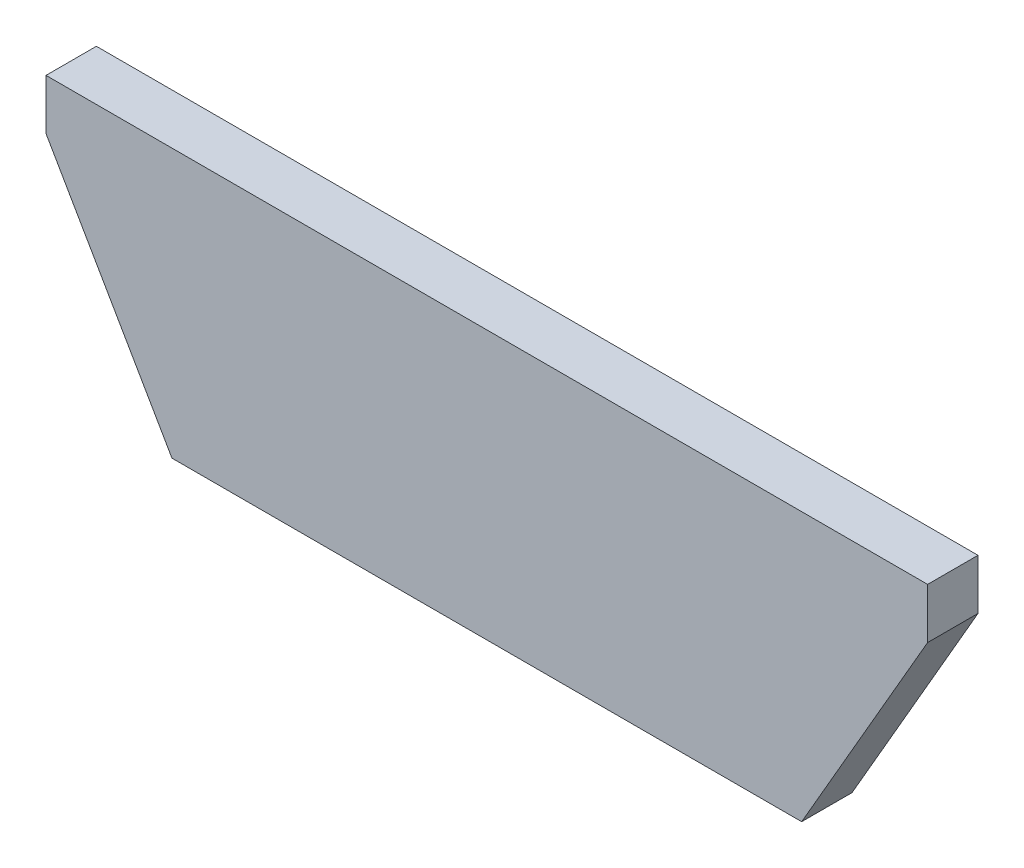
ISO-10303-21;
HEADER;
FILE_DESCRIPTION(('STEP AP214'),'2;1');
FILE_NAME('part.step','',(''),(''),'','','');
FILE_SCHEMA(('AUTOMOTIVE_DESIGN { 1 0 10303 214 1 1 1 1 }'));
ENDSEC;
DATA;
#1=APPLICATION_CONTEXT('core data for automotive mechanical design processes');
#2=APPLICATION_PROTOCOL_DEFINITION('international standard','automotive_design',2000,#1);
#3=PRODUCT_CONTEXT('',#1,'mechanical');
#4=PRODUCT('Part','Part','',(#3));
#5=PRODUCT_RELATED_PRODUCT_CATEGORY('part','',(#4));
#6=PRODUCT_DEFINITION_FORMATION('','',#4);
#7=PRODUCT_DEFINITION_CONTEXT('part definition',#1,'design');
#8=PRODUCT_DEFINITION('design','',#6,#7);
#9=PRODUCT_DEFINITION_SHAPE('','',#8);
#10=(LENGTH_UNIT() NAMED_UNIT(*) SI_UNIT(.MILLI.,.METRE.));
#11=(NAMED_UNIT(*) PLANE_ANGLE_UNIT() SI_UNIT($,.RADIAN.));
#12=(NAMED_UNIT(*) SI_UNIT($,.STERADIAN.) SOLID_ANGLE_UNIT());
#13=UNCERTAINTY_MEASURE_WITH_UNIT(LENGTH_MEASURE(1.E-05),#10,'distance_accuracy_value','');
#14=(GEOMETRIC_REPRESENTATION_CONTEXT(3) GLOBAL_UNCERTAINTY_ASSIGNED_CONTEXT((#13)) GLOBAL_UNIT_ASSIGNED_CONTEXT((#10,
#11,#12)) REPRESENTATION_CONTEXT('',''));
#15=CARTESIAN_POINT('',(0.,0.,0.));
#16=DIRECTION('',(0.,0.,1.));
#17=DIRECTION('',(1.,0.,0.));
#18=AXIS2_PLACEMENT_3D('',#15,#16,#17);
#19=CARTESIAN_POINT('',(0.,0.,5.08));
#20=DIRECTION('',(0.866025403784436,0.500000000000004,0.));
#21=DIRECTION('',(-0.500000000000004,0.866025403784436,0.));
#22=AXIS2_PLACEMENT_3D('',#19,#20,#21);
#23=PLANE('',#22);
#24=DIRECTION('',(0.500000000000004,-0.866025403784436,0.));
#25=VECTOR('',#24,1.);
#26=CARTESIAN_POINT('',(0.,0.,0.));
#27=LINE('',#26,#25);
#28=CARTESIAN_POINT('',(-12.7000000000001,21.9970452561247,0.));
#29=VERTEX_POINT('',#28);
#30=CARTESIAN_POINT('',(0.,0.,0.));
#31=VERTEX_POINT('',#30);
#32=EDGE_CURVE('E117',#29,#31,#27,.T.);
#33=ORIENTED_EDGE('',*,*,#32,.T.);
#34=DIRECTION('',(0.,0.,-1.));
#35=VECTOR('',#34,1.);
#36=CARTESIAN_POINT('',(0.,0.,5.08));
#37=LINE('',#36,#35);
#38=CARTESIAN_POINT('',(0.,0.,5.08));
#39=VERTEX_POINT('',#38);
#40=EDGE_CURVE('E11',#39,#31,#37,.T.);
#41=ORIENTED_EDGE('',*,*,#40,.F.);
#42=DIRECTION('',(0.500000000000004,-0.866025403784436,0.));
#43=VECTOR('',#42,1.);
#44=CARTESIAN_POINT('',(0.,0.,5.08));
#45=LINE('',#44,#43);
#46=CARTESIAN_POINT('',(-12.7000000000001,21.9970452561247,5.08));
#47=VERTEX_POINT('',#46);
#48=EDGE_CURVE('E127',#47,#39,#45,.T.);
#49=ORIENTED_EDGE('',*,*,#48,.F.);
#50=DIRECTION('',(0.,0.,-1.));
#51=VECTOR('',#50,1.);
#52=CARTESIAN_POINT('',(-12.7000000000001,21.9970452561247,5.08));
#53=LINE('',#52,#51);
#54=EDGE_CURVE('E113',#47,#29,#53,.T.);
#55=ORIENTED_EDGE('',*,*,#54,.T.);
#56=EDGE_LOOP('',(#33,#41,#49,#55));
#57=FACE_BOUND('',#56,.T.);
#58=ADVANCED_FACE('F33',(#57),#23,.F.);
#59=CARTESIAN_POINT('',(0.,0.,5.08));
#60=DIRECTION('',(0.,1.,0.));
#61=DIRECTION('',(0.,0.,1.));
#62=AXIS2_PLACEMENT_3D('',#59,#60,#61);
#63=PLANE('',#62);
#64=DIRECTION('',(1.,0.,0.));
#65=VECTOR('',#64,1.);
#66=CARTESIAN_POINT('',(0.,0.,0.));
#67=LINE('',#66,#65);
#68=CARTESIAN_POINT('',(63.5,0.,0.));
#69=VERTEX_POINT('',#68);
#70=EDGE_CURVE('E120',#31,#69,#67,.T.);
#71=ORIENTED_EDGE('',*,*,#70,.T.);
#72=DIRECTION('',(0.,0.,-1.));
#73=VECTOR('',#72,1.);
#74=CARTESIAN_POINT('',(63.5,0.,5.08));
#75=LINE('',#74,#73);
#76=CARTESIAN_POINT('',(63.5,0.,5.08));
#77=VERTEX_POINT('',#76);
#78=EDGE_CURVE('E41',#77,#69,#75,.T.);
#79=ORIENTED_EDGE('',*,*,#78,.F.);
#80=DIRECTION('',(1.,0.,0.));
#81=VECTOR('',#80,1.);
#82=CARTESIAN_POINT('',(0.,0.,5.08));
#83=LINE('',#82,#81);
#84=EDGE_CURVE('E86',#39,#77,#83,.T.);
#85=ORIENTED_EDGE('',*,*,#84,.F.);
#86=ORIENTED_EDGE('',*,*,#40,.T.);
#87=EDGE_LOOP('',(#71,#79,#85,#86));
#88=FACE_BOUND('',#87,.T.);
#89=ADVANCED_FACE('F151',(#88),#63,.F.);
#90=CARTESIAN_POINT('',(63.5,0.,5.08));
#91=DIRECTION('',(-0.86602540378444,0.499999999999998,0.));
#92=DIRECTION('',(-0.499999999999998,-0.86602540378444,0.));
#93=AXIS2_PLACEMENT_3D('',#90,#91,#92);
#94=PLANE('',#93);
#95=DIRECTION('',(0.499999999999998,0.86602540378444,0.));
#96=VECTOR('',#95,1.);
#97=CARTESIAN_POINT('',(63.5,0.,0.));
#98=LINE('',#97,#96);
#99=CARTESIAN_POINT('',(76.1999999999999,21.9970452561248,0.));
#100=VERTEX_POINT('',#99);
#101=EDGE_CURVE('E122',#69,#100,#98,.T.);
#102=ORIENTED_EDGE('',*,*,#101,.T.);
#103=DIRECTION('',(0.,0.,-1.));
#104=VECTOR('',#103,1.);
#105=CARTESIAN_POINT('',(76.1999999999999,21.9970452561248,5.08));
#106=LINE('',#105,#104);
#107=CARTESIAN_POINT('',(76.1999999999999,21.9970452561248,5.08));
#108=VERTEX_POINT('',#107);
#109=EDGE_CURVE('E108',#108,#100,#106,.T.);
#110=ORIENTED_EDGE('',*,*,#109,.F.);
#111=DIRECTION('',(0.499999999999998,0.86602540378444,0.));
#112=VECTOR('',#111,1.);
#113=CARTESIAN_POINT('',(63.5,0.,5.08));
#114=LINE('',#113,#112);
#115=EDGE_CURVE('E99',#77,#108,#114,.T.);
#116=ORIENTED_EDGE('',*,*,#115,.F.);
#117=ORIENTED_EDGE('',*,*,#78,.T.);
#118=EDGE_LOOP('',(#102,#110,#116,#117));
#119=FACE_BOUND('',#118,.T.);
#120=ADVANCED_FACE('F133',(#119),#94,.F.);
#121=CARTESIAN_POINT('',(76.1999999999999,21.9970452561248,5.08));
#122=DIRECTION('',(-1.,0.,0.));
#123=DIRECTION('',(0.,-1.,0.));
#124=AXIS2_PLACEMENT_3D('',#121,#122,#123);
#125=PLANE('',#124);
#126=DIRECTION('',(0.,1.,0.));
#127=VECTOR('',#126,1.);
#128=CARTESIAN_POINT('',(76.1999999999999,21.9970452561248,0.));
#129=LINE('',#128,#127);
#130=CARTESIAN_POINT('',(76.1999999999999,27.0770452561248,0.));
#131=VERTEX_POINT('',#130);
#132=EDGE_CURVE('E107',#100,#131,#129,.T.);
#133=ORIENTED_EDGE('',*,*,#132,.T.);
#134=DIRECTION('',(0.,0.,-1.));
#135=VECTOR('',#134,1.);
#136=CARTESIAN_POINT('',(76.1999999999999,27.0770452561248,5.08));
#137=LINE('',#136,#135);
#138=CARTESIAN_POINT('',(76.1999999999999,27.0770452561248,5.08));
#139=VERTEX_POINT('',#138);
#140=EDGE_CURVE('E104',#139,#131,#137,.T.);
#141=ORIENTED_EDGE('',*,*,#140,.F.);
#142=DIRECTION('',(0.,1.,0.));
#143=VECTOR('',#142,1.);
#144=CARTESIAN_POINT('',(76.1999999999999,21.9970452561248,5.08));
#145=LINE('',#144,#143);
#146=EDGE_CURVE('E93',#108,#139,#145,.T.);
#147=ORIENTED_EDGE('',*,*,#146,.F.);
#148=ORIENTED_EDGE('',*,*,#109,.T.);
#149=EDGE_LOOP('',(#133,#141,#147,#148));
#150=FACE_BOUND('',#149,.T.);
#151=ADVANCED_FACE('F105',(#150),#125,.F.);
#152=CARTESIAN_POINT('',(-12.7000000000001,27.0770452561247,5.08));
#153=DIRECTION('',(0.,-1.,0.));
#154=DIRECTION('',(1.,0.,0.));
#155=AXIS2_PLACEMENT_3D('',#152,#153,#154);
#156=PLANE('',#155);
#157=DIRECTION('',(-1.,0.,0.));
#158=VECTOR('',#157,1.);
#159=CARTESIAN_POINT('',(-12.7000000000001,27.0770452561247,0.));
#160=LINE('',#159,#158);
#161=CARTESIAN_POINT('',(-12.7000000000001,27.0770452561247,0.));
#162=VERTEX_POINT('',#161);
#163=EDGE_CURVE('E72',#131,#162,#160,.T.);
#164=ORIENTED_EDGE('',*,*,#163,.T.);
#165=DIRECTION('',(0.,0.,-1.));
#166=VECTOR('',#165,1.);
#167=CARTESIAN_POINT('',(-12.7000000000001,27.0770452561247,5.08));
#168=LINE('',#167,#166);
#169=CARTESIAN_POINT('',(-12.7000000000001,27.0770452561247,5.08));
#170=VERTEX_POINT('',#169);
#171=EDGE_CURVE('E109',#170,#162,#168,.T.);
#172=ORIENTED_EDGE('',*,*,#171,.F.);
#173=DIRECTION('',(-1.,0.,0.));
#174=VECTOR('',#173,1.);
#175=CARTESIAN_POINT('',(-12.7000000000001,27.0770452561247,5.08));
#176=LINE('',#175,#174);
#177=EDGE_CURVE('E97',#139,#170,#176,.T.);
#178=ORIENTED_EDGE('',*,*,#177,.F.);
#179=ORIENTED_EDGE('',*,*,#140,.T.);
#180=EDGE_LOOP('',(#164,#172,#178,#179));
#181=FACE_BOUND('',#180,.T.);
#182=ADVANCED_FACE('F111',(#181),#156,.F.);
#183=CARTESIAN_POINT('',(-12.7000000000001,21.9970452561247,5.08));
#184=DIRECTION('',(1.,0.,0.));
#185=DIRECTION('',(0.,0.,-1.));
#186=AXIS2_PLACEMENT_3D('',#183,#184,#185);
#187=PLANE('',#186);
#188=DIRECTION('',(0.,-1.,0.));
#189=VECTOR('',#188,1.);
#190=CARTESIAN_POINT('',(-12.7000000000001,21.9970452561247,0.));
#191=LINE('',#190,#189);
#192=EDGE_CURVE('E78',#162,#29,#191,.T.);
#193=ORIENTED_EDGE('',*,*,#192,.T.);
#194=ORIENTED_EDGE('',*,*,#54,.F.);
#195=DIRECTION('',(0.,-1.,0.));
#196=VECTOR('',#195,1.);
#197=CARTESIAN_POINT('',(-12.7000000000001,21.9970452561247,5.08));
#198=LINE('',#197,#196);
#199=EDGE_CURVE('E49',#170,#47,#198,.T.);
#200=ORIENTED_EDGE('',*,*,#199,.F.);
#201=ORIENTED_EDGE('',*,*,#171,.T.);
#202=EDGE_LOOP('',(#193,#194,#200,#201));
#203=FACE_BOUND('',#202,.T.);
#204=ADVANCED_FACE('F140',(#203),#187,.F.);
#205=CARTESIAN_POINT('',(0.,0.,5.08));
#206=DIRECTION('',(0.,0.,-1.));
#207=DIRECTION('',(-1.,0.,0.));
#208=AXIS2_PLACEMENT_3D('',#205,#206,#207);
#209=PLANE('',#208);
#210=ORIENTED_EDGE('',*,*,#48,.T.);
#211=ORIENTED_EDGE('',*,*,#84,.T.);
#212=ORIENTED_EDGE('',*,*,#115,.T.);
#213=ORIENTED_EDGE('',*,*,#146,.T.);
#214=ORIENTED_EDGE('',*,*,#177,.T.);
#215=ORIENTED_EDGE('',*,*,#199,.T.);
#216=EDGE_LOOP('',(#210,#211,#212,#213,#214,#215));
#217=FACE_BOUND('',#216,.T.);
#218=ADVANCED_FACE('F95',(#217),#209,.F.);
#219=CARTESIAN_POINT('',(0.,0.,0.));
#220=DIRECTION('',(0.,0.,-1.));
#221=DIRECTION('',(-1.,0.,0.));
#222=AXIS2_PLACEMENT_3D('',#219,#220,#221);
#223=PLANE('',#222);
#224=ORIENTED_EDGE('',*,*,#32,.F.);
#225=ORIENTED_EDGE('',*,*,#192,.F.);
#226=ORIENTED_EDGE('',*,*,#163,.F.);
#227=ORIENTED_EDGE('',*,*,#132,.F.);
#228=ORIENTED_EDGE('',*,*,#101,.F.);
#229=ORIENTED_EDGE('',*,*,#70,.F.);
#230=EDGE_LOOP('',(#224,#225,#226,#227,#228,#229));
#231=FACE_BOUND('',#230,.T.);
#232=ADVANCED_FACE('F136',(#231),#223,.T.);
#233=CLOSED_SHELL('',(#58,#89,#120,#151,#182,#204,#218,#232));
#234=MANIFOLD_SOLID_BREP('B2',#233);
#235=ADVANCED_BREP_SHAPE_REPRESENTATION('',(#18,#234),#14);
#236=SHAPE_DEFINITION_REPRESENTATION(#9,#235);
ENDSEC;
END-ISO-10303-21;
